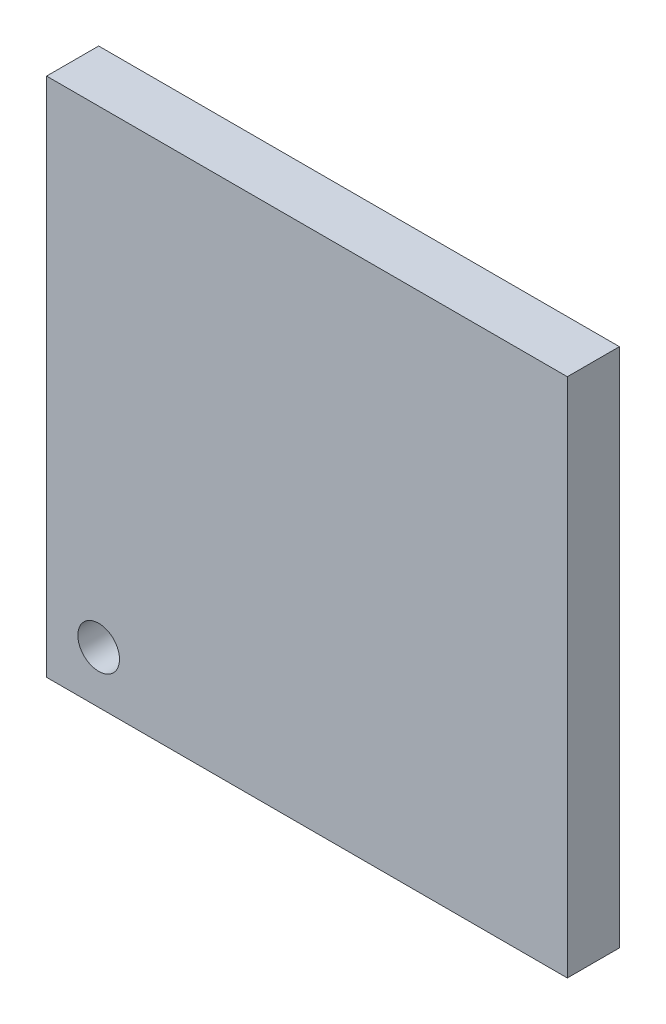
ISO-10303-21;
HEADER;
FILE_DESCRIPTION(('STEP AP214'),'2;1');
FILE_NAME('part.step','',(''),(''),'','','');
FILE_SCHEMA(('AUTOMOTIVE_DESIGN { 1 0 10303 214 1 1 1 1 }'));
ENDSEC;
DATA;
#1=APPLICATION_CONTEXT('core data for automotive mechanical design processes');
#2=APPLICATION_PROTOCOL_DEFINITION('international standard','automotive_design',2000,#1);
#3=PRODUCT_CONTEXT('',#1,'mechanical');
#4=PRODUCT('Part','Part','',(#3));
#5=PRODUCT_RELATED_PRODUCT_CATEGORY('part','',(#4));
#6=PRODUCT_DEFINITION_FORMATION('','',#4);
#7=PRODUCT_DEFINITION_CONTEXT('part definition',#1,'design');
#8=PRODUCT_DEFINITION('design','',#6,#7);
#9=PRODUCT_DEFINITION_SHAPE('','',#8);
#10=(LENGTH_UNIT() NAMED_UNIT(*) SI_UNIT(.MILLI.,.METRE.));
#11=(NAMED_UNIT(*) PLANE_ANGLE_UNIT() SI_UNIT($,.RADIAN.));
#12=(NAMED_UNIT(*) SI_UNIT($,.STERADIAN.) SOLID_ANGLE_UNIT());
#13=UNCERTAINTY_MEASURE_WITH_UNIT(LENGTH_MEASURE(1.E-05),#10,'distance_accuracy_value','');
#14=(GEOMETRIC_REPRESENTATION_CONTEXT(3) GLOBAL_UNCERTAINTY_ASSIGNED_CONTEXT((#13)) GLOBAL_UNIT_ASSIGNED_CONTEXT((#10,
#11,#12)) REPRESENTATION_CONTEXT('',''));
#15=CARTESIAN_POINT('',(0.,0.,0.));
#16=DIRECTION('',(0.,0.,1.));
#17=DIRECTION('',(1.,0.,0.));
#18=AXIS2_PLACEMENT_3D('',#15,#16,#17);
#19=CARTESIAN_POINT('',(-50.,50.,10.));
#20=DIRECTION('',(1.,0.,0.));
#21=DIRECTION('',(0.,1.,0.));
#22=AXIS2_PLACEMENT_3D('',#19,#20,#21);
#23=PLANE('',#22);
#24=DIRECTION('',(0.,-1.,0.));
#25=VECTOR('',#24,1.);
#26=CARTESIAN_POINT('',(-50.,50.,0.));
#27=LINE('',#26,#25);
#28=CARTESIAN_POINT('',(-50.,50.,0.));
#29=VERTEX_POINT('',#28);
#30=CARTESIAN_POINT('',(-50.,-50.,0.));
#31=VERTEX_POINT('',#30);
#32=EDGE_CURVE('E96',#29,#31,#27,.T.);
#33=ORIENTED_EDGE('',*,*,#32,.T.);
#34=DIRECTION('',(0.,0.,-1.));
#35=VECTOR('',#34,1.);
#36=CARTESIAN_POINT('',(-50.,-50.,10.));
#37=LINE('',#36,#35);
#38=CARTESIAN_POINT('',(-50.,-50.,10.));
#39=VERTEX_POINT('',#38);
#40=EDGE_CURVE('E11',#39,#31,#37,.T.);
#41=ORIENTED_EDGE('',*,*,#40,.F.);
#42=DIRECTION('',(0.,-1.,0.));
#43=VECTOR('',#42,1.);
#44=CARTESIAN_POINT('',(-50.,50.,10.));
#45=LINE('',#44,#43);
#46=CARTESIAN_POINT('',(-50.,50.,10.));
#47=VERTEX_POINT('',#46);
#48=EDGE_CURVE('E84',#47,#39,#45,.T.);
#49=ORIENTED_EDGE('',*,*,#48,.F.);
#50=DIRECTION('',(0.,0.,-1.));
#51=VECTOR('',#50,1.);
#52=CARTESIAN_POINT('',(-50.,50.,10.));
#53=LINE('',#52,#51);
#54=EDGE_CURVE('E92',#47,#29,#53,.T.);
#55=ORIENTED_EDGE('',*,*,#54,.T.);
#56=EDGE_LOOP('',(#33,#41,#49,#55));
#57=FACE_BOUND('',#56,.T.);
#58=ADVANCED_FACE('F33',(#57),#23,.F.);
#59=CARTESIAN_POINT('',(50.,-50.,10.));
#60=DIRECTION('',(0.,1.,0.));
#61=DIRECTION('',(-1.,0.,0.));
#62=AXIS2_PLACEMENT_3D('',#59,#60,#61);
#63=PLANE('',#62);
#64=DIRECTION('',(1.,0.,0.));
#65=VECTOR('',#64,1.);
#66=CARTESIAN_POINT('',(50.,-50.,0.));
#67=LINE('',#66,#65);
#68=CARTESIAN_POINT('',(50.,-50.,0.));
#69=VERTEX_POINT('',#68);
#70=EDGE_CURVE('E88',#31,#69,#67,.T.);
#71=ORIENTED_EDGE('',*,*,#70,.T.);
#72=DIRECTION('',(0.,0.,-1.));
#73=VECTOR('',#72,1.);
#74=CARTESIAN_POINT('',(50.,-50.,10.));
#75=LINE('',#74,#73);
#76=CARTESIAN_POINT('',(50.,-50.,10.));
#77=VERTEX_POINT('',#76);
#78=EDGE_CURVE('E41',#77,#69,#75,.T.);
#79=ORIENTED_EDGE('',*,*,#78,.F.);
#80=DIRECTION('',(1.,0.,0.));
#81=VECTOR('',#80,1.);
#82=CARTESIAN_POINT('',(50.,-50.,10.));
#83=LINE('',#82,#81);
#84=EDGE_CURVE('E79',#39,#77,#83,.T.);
#85=ORIENTED_EDGE('',*,*,#84,.F.);
#86=ORIENTED_EDGE('',*,*,#40,.T.);
#87=EDGE_LOOP('',(#71,#79,#85,#86));
#88=FACE_BOUND('',#87,.T.);
#89=ADVANCED_FACE('F87',(#88),#63,.F.);
#90=CARTESIAN_POINT('',(50.,50.,10.));
#91=DIRECTION('',(-1.,0.,0.));
#92=DIRECTION('',(0.,-1.,0.));
#93=AXIS2_PLACEMENT_3D('',#90,#91,#92);
#94=PLANE('',#93);
#95=DIRECTION('',(0.,1.,0.));
#96=VECTOR('',#95,1.);
#97=CARTESIAN_POINT('',(50.,50.,0.));
#98=LINE('',#97,#96);
#99=CARTESIAN_POINT('',(50.,50.,0.));
#100=VERTEX_POINT('',#99);
#101=EDGE_CURVE('E66',#69,#100,#98,.T.);
#102=ORIENTED_EDGE('',*,*,#101,.T.);
#103=DIRECTION('',(0.,0.,-1.));
#104=VECTOR('',#103,1.);
#105=CARTESIAN_POINT('',(50.,50.,10.));
#106=LINE('',#105,#104);
#107=CARTESIAN_POINT('',(50.,50.,10.));
#108=VERTEX_POINT('',#107);
#109=EDGE_CURVE('E89',#108,#100,#106,.T.);
#110=ORIENTED_EDGE('',*,*,#109,.F.);
#111=DIRECTION('',(0.,1.,0.));
#112=VECTOR('',#111,1.);
#113=CARTESIAN_POINT('',(50.,50.,10.));
#114=LINE('',#113,#112);
#115=EDGE_CURVE('E82',#77,#108,#114,.T.);
#116=ORIENTED_EDGE('',*,*,#115,.F.);
#117=ORIENTED_EDGE('',*,*,#78,.T.);
#118=EDGE_LOOP('',(#102,#110,#116,#117));
#119=FACE_BOUND('',#118,.T.);
#120=ADVANCED_FACE('F90',(#119),#94,.F.);
#121=CARTESIAN_POINT('',(50.,50.,10.));
#122=DIRECTION('',(0.,-1.,0.));
#123=DIRECTION('',(1.,0.,0.));
#124=AXIS2_PLACEMENT_3D('',#121,#122,#123);
#125=PLANE('',#124);
#126=DIRECTION('',(-1.,0.,0.));
#127=VECTOR('',#126,1.);
#128=CARTESIAN_POINT('',(50.,50.,0.));
#129=LINE('',#128,#127);
#130=EDGE_CURVE('E72',#100,#29,#129,.T.);
#131=ORIENTED_EDGE('',*,*,#130,.T.);
#132=ORIENTED_EDGE('',*,*,#54,.F.);
#133=DIRECTION('',(-1.,0.,0.));
#134=VECTOR('',#133,1.);
#135=CARTESIAN_POINT('',(50.,50.,10.));
#136=LINE('',#135,#134);
#137=EDGE_CURVE('E49',#108,#47,#136,.T.);
#138=ORIENTED_EDGE('',*,*,#137,.F.);
#139=ORIENTED_EDGE('',*,*,#109,.T.);
#140=EDGE_LOOP('',(#131,#132,#138,#139));
#141=FACE_BOUND('',#140,.T.);
#142=ADVANCED_FACE('F104',(#141),#125,.F.);
#143=CARTESIAN_POINT('',(0.,0.,10.));
#144=DIRECTION('',(0.,0.,-1.));
#145=DIRECTION('',(-1.,0.,0.));
#146=AXIS2_PLACEMENT_3D('',#143,#144,#145);
#147=PLANE('',#146);
#148=CARTESIAN_POINT('',(-40.,-40.,10.));
#149=DIRECTION('',(0.,0.,1.));
#150=DIRECTION('',(1.,0.,0.));
#151=AXIS2_PLACEMENT_3D('',#148,#149,#150);
#152=CIRCLE('',#151,4.00000000000001);
#153=CARTESIAN_POINT('',(-36.,-40.,10.));
#154=VERTEX_POINT('',#153);
#155=EDGE_CURVE('E99',#154,#154,#152,.T.);
#156=ORIENTED_EDGE('',*,*,#155,.F.);
#157=EDGE_LOOP('',(#156));
#158=FACE_BOUND('',#157,.T.);
#159=ORIENTED_EDGE('',*,*,#48,.T.);
#160=ORIENTED_EDGE('',*,*,#84,.T.);
#161=ORIENTED_EDGE('',*,*,#115,.T.);
#162=ORIENTED_EDGE('',*,*,#137,.T.);
#163=EDGE_LOOP('',(#159,#160,#161,#162));
#164=FACE_BOUND('',#163,.T.);
#165=ADVANCED_FACE('F80',(#158,#164),#147,.F.);
#166=CARTESIAN_POINT('',(0.,0.,0.));
#167=DIRECTION('',(0.,0.,-1.));
#168=DIRECTION('',(-1.,0.,0.));
#169=AXIS2_PLACEMENT_3D('',#166,#167,#168);
#170=PLANE('',#169);
#171=CARTESIAN_POINT('',(-40.,-40.,0.));
#172=DIRECTION('',(0.,0.,-1.));
#173=DIRECTION('',(-1.,0.,0.));
#174=AXIS2_PLACEMENT_3D('',#171,#172,#173);
#175=CIRCLE('',#174,4.00000000000001);
#176=CARTESIAN_POINT('',(-44.,-40.,0.));
#177=VERTEX_POINT('',#176);
#178=EDGE_CURVE('E110',#177,#177,#175,.F.);
#179=ORIENTED_EDGE('',*,*,#178,.T.);
#180=EDGE_LOOP('',(#179));
#181=FACE_BOUND('',#180,.T.);
#182=ORIENTED_EDGE('',*,*,#32,.F.);
#183=ORIENTED_EDGE('',*,*,#130,.F.);
#184=ORIENTED_EDGE('',*,*,#101,.F.);
#185=ORIENTED_EDGE('',*,*,#70,.F.);
#186=EDGE_LOOP('',(#182,#183,#184,#185));
#187=FACE_BOUND('',#186,.T.);
#188=ADVANCED_FACE('F107',(#181,#187),#170,.T.);
#189=CARTESIAN_POINT('',(-40.,-40.,-0.000999999999999265));
#190=DIRECTION('',(0.,0.,1.));
#191=DIRECTION('',(1.,0.,0.));
#192=AXIS2_PLACEMENT_3D('',#189,#190,#191);
#193=CYLINDRICAL_SURFACE('',#192,4.00000000000001);
#194=ORIENTED_EDGE('',*,*,#178,.F.);
#195=EDGE_LOOP('',(#194));
#196=FACE_BOUND('',#195,.T.);
#197=ORIENTED_EDGE('',*,*,#155,.T.);
#198=EDGE_LOOP('',(#197));
#199=FACE_BOUND('',#198,.T.);
#200=ADVANCED_FACE('F116',(#196,#199),#193,.F.);
#201=CLOSED_SHELL('',(#58,#89,#120,#142,#165,#188,#200));
#202=MANIFOLD_SOLID_BREP('B2',#201);
#203=ADVANCED_BREP_SHAPE_REPRESENTATION('',(#18,#202),#14);
#204=SHAPE_DEFINITION_REPRESENTATION(#9,#203);
ENDSEC;
END-ISO-10303-21;
